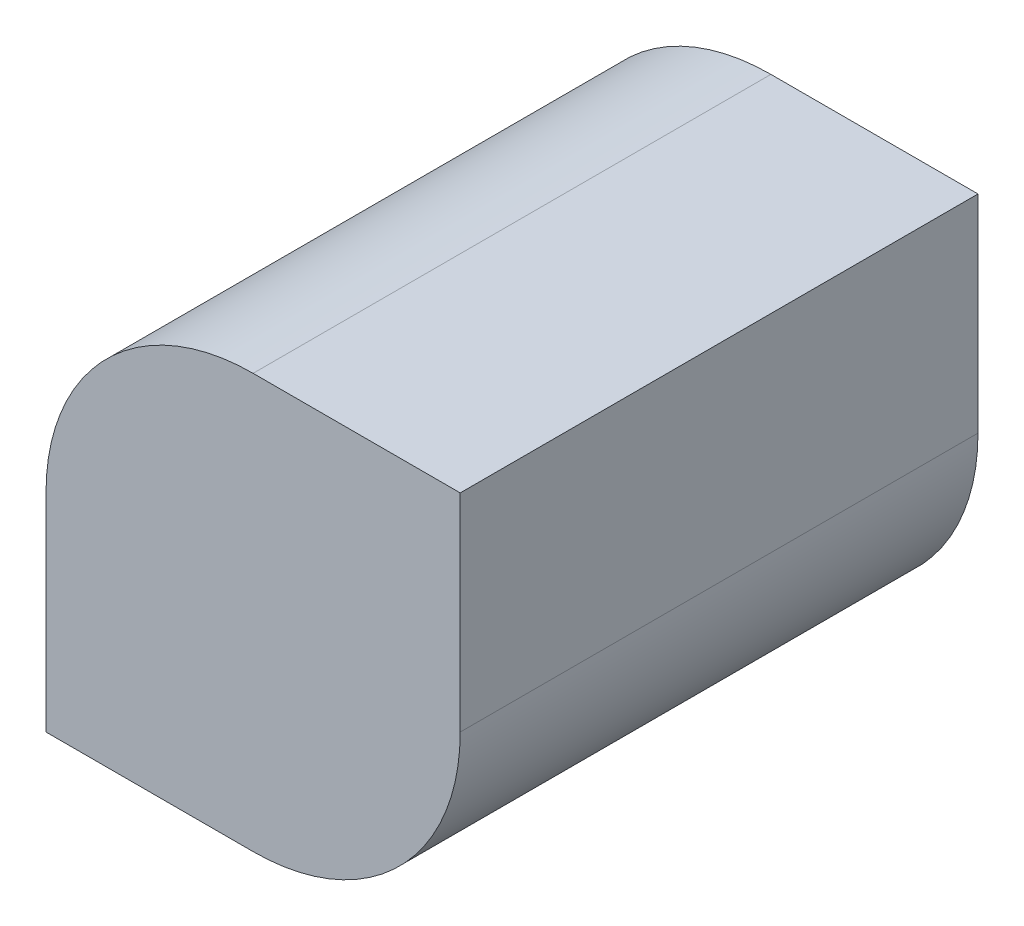
ISO-10303-21;
HEADER;
FILE_DESCRIPTION(('STEP AP214'),'2;1');
FILE_NAME('part.step','',(''),(''),'','','');
FILE_SCHEMA(('AUTOMOTIVE_DESIGN { 1 0 10303 214 1 1 1 1 }'));
ENDSEC;
DATA;
#1=APPLICATION_CONTEXT('core data for automotive mechanical design processes');
#2=APPLICATION_PROTOCOL_DEFINITION('international standard','automotive_design',2000,#1);
#3=PRODUCT_CONTEXT('',#1,'mechanical');
#4=PRODUCT('Part','Part','',(#3));
#5=PRODUCT_RELATED_PRODUCT_CATEGORY('part','',(#4));
#6=PRODUCT_DEFINITION_FORMATION('','',#4);
#7=PRODUCT_DEFINITION_CONTEXT('part definition',#1,'design');
#8=PRODUCT_DEFINITION('design','',#6,#7);
#9=PRODUCT_DEFINITION_SHAPE('','',#8);
#10=(LENGTH_UNIT() NAMED_UNIT(*) SI_UNIT(.MILLI.,.METRE.));
#11=(NAMED_UNIT(*) PLANE_ANGLE_UNIT() SI_UNIT($,.RADIAN.));
#12=(NAMED_UNIT(*) SI_UNIT($,.STERADIAN.) SOLID_ANGLE_UNIT());
#13=UNCERTAINTY_MEASURE_WITH_UNIT(LENGTH_MEASURE(1.E-05),#10,'distance_accuracy_value','');
#14=(GEOMETRIC_REPRESENTATION_CONTEXT(3) GLOBAL_UNCERTAINTY_ASSIGNED_CONTEXT((#13)) GLOBAL_UNIT_ASSIGNED_CONTEXT((#10,
#11,#12)) REPRESENTATION_CONTEXT('',''));
#15=CARTESIAN_POINT('',(0.,0.,0.));
#16=DIRECTION('',(0.,0.,1.));
#17=DIRECTION('',(1.,0.,0.));
#18=AXIS2_PLACEMENT_3D('',#15,#16,#17);
#19=CARTESIAN_POINT('',(-10.,10.,25.));
#20=DIRECTION('',(1.,0.,0.));
#21=DIRECTION('',(0.,1.,0.));
#22=AXIS2_PLACEMENT_3D('',#19,#20,#21);
#23=PLANE('',#22);
#24=DIRECTION('',(0.,-1.,0.));
#25=VECTOR('',#24,1.);
#26=CARTESIAN_POINT('',(-10.,10.,0.));
#27=LINE('',#26,#25);
#28=CARTESIAN_POINT('',(-10.,10.,0.));
#29=VERTEX_POINT('',#28);
#30=CARTESIAN_POINT('',(-10.,0.,0.));
#31=VERTEX_POINT('',#30);
#32=EDGE_CURVE('E117',#29,#31,#27,.T.);
#33=ORIENTED_EDGE('',*,*,#32,.T.);
#34=DIRECTION('',(0.,0.,-1.));
#35=VECTOR('',#34,1.);
#36=CARTESIAN_POINT('',(-10.,0.,25.));
#37=LINE('',#36,#35);
#38=CARTESIAN_POINT('',(-10.,0.,25.));
#39=VERTEX_POINT('',#38);
#40=EDGE_CURVE('E11',#39,#31,#37,.T.);
#41=ORIENTED_EDGE('',*,*,#40,.F.);
#42=DIRECTION('',(0.,-1.,0.));
#43=VECTOR('',#42,1.);
#44=CARTESIAN_POINT('',(-10.,10.,25.));
#45=LINE('',#44,#43);
#46=CARTESIAN_POINT('',(-10.,10.,25.));
#47=VERTEX_POINT('',#46);
#48=EDGE_CURVE('E127',#47,#39,#45,.T.);
#49=ORIENTED_EDGE('',*,*,#48,.F.);
#50=DIRECTION('',(0.,0.,-1.));
#51=VECTOR('',#50,1.);
#52=CARTESIAN_POINT('',(-10.,10.,25.));
#53=LINE('',#52,#51);
#54=EDGE_CURVE('E113',#47,#29,#53,.T.);
#55=ORIENTED_EDGE('',*,*,#54,.T.);
#56=EDGE_LOOP('',(#33,#41,#49,#55));
#57=FACE_BOUND('',#56,.T.);
#58=ADVANCED_FACE('F33',(#57),#23,.F.);
#59=CARTESIAN_POINT('',(-10.,0.,25.));
#60=DIRECTION('',(0.,1.,0.));
#61=DIRECTION('',(0.,0.,1.));
#62=AXIS2_PLACEMENT_3D('',#59,#60,#61);
#63=PLANE('',#62);
#64=DIRECTION('',(1.,0.,0.));
#65=VECTOR('',#64,1.);
#66=CARTESIAN_POINT('',(-10.,0.,0.));
#67=LINE('',#66,#65);
#68=CARTESIAN_POINT('',(0.,0.,0.));
#69=VERTEX_POINT('',#68);
#70=EDGE_CURVE('E120',#31,#69,#67,.T.);
#71=ORIENTED_EDGE('',*,*,#70,.T.);
#72=DIRECTION('',(0.,0.,-1.));
#73=VECTOR('',#72,1.);
#74=CARTESIAN_POINT('',(0.,0.,25.));
#75=LINE('',#74,#73);
#76=CARTESIAN_POINT('',(0.,0.,25.));
#77=VERTEX_POINT('',#76);
#78=EDGE_CURVE('E41',#77,#69,#75,.T.);
#79=ORIENTED_EDGE('',*,*,#78,.F.);
#80=DIRECTION('',(1.,0.,0.));
#81=VECTOR('',#80,1.);
#82=CARTESIAN_POINT('',(-10.,0.,25.));
#83=LINE('',#82,#81);
#84=EDGE_CURVE('E86',#39,#77,#83,.T.);
#85=ORIENTED_EDGE('',*,*,#84,.F.);
#86=ORIENTED_EDGE('',*,*,#40,.T.);
#87=EDGE_LOOP('',(#71,#79,#85,#86));
#88=FACE_BOUND('',#87,.T.);
#89=ADVANCED_FACE('F151',(#88),#63,.F.);
#90=CARTESIAN_POINT('',(0.,10.,25.));
#91=DIRECTION('',(0.,0.,-1.));
#92=DIRECTION('',(-1.,0.,0.));
#93=AXIS2_PLACEMENT_3D('',#90,#91,#92);
#94=CYLINDRICAL_SURFACE('',#93,10.);
#95=CARTESIAN_POINT('',(0.,10.,0.));
#96=DIRECTION('',(0.,0.,1.));
#97=DIRECTION('',(1.,0.,0.));
#98=AXIS2_PLACEMENT_3D('',#95,#96,#97);
#99=CIRCLE('',#98,10.);
#100=CARTESIAN_POINT('',(10.,10.,0.));
#101=VERTEX_POINT('',#100);
#102=EDGE_CURVE('E122',#69,#101,#99,.T.);
#103=ORIENTED_EDGE('',*,*,#102,.T.);
#104=DIRECTION('',(0.,0.,-1.));
#105=VECTOR('',#104,1.);
#106=CARTESIAN_POINT('',(10.,10.,25.));
#107=LINE('',#106,#105);
#108=CARTESIAN_POINT('',(10.,10.,25.));
#109=VERTEX_POINT('',#108);
#110=EDGE_CURVE('E108',#109,#101,#107,.T.);
#111=ORIENTED_EDGE('',*,*,#110,.F.);
#112=CARTESIAN_POINT('',(0.,10.,25.));
#113=DIRECTION('',(0.,0.,1.));
#114=DIRECTION('',(1.,0.,0.));
#115=AXIS2_PLACEMENT_3D('',#112,#113,#114);
#116=CIRCLE('',#115,10.);
#117=EDGE_CURVE('E99',#77,#109,#116,.T.);
#118=ORIENTED_EDGE('',*,*,#117,.F.);
#119=ORIENTED_EDGE('',*,*,#78,.T.);
#120=EDGE_LOOP('',(#103,#111,#118,#119));
#121=FACE_BOUND('',#120,.T.);
#122=ADVANCED_FACE('F133',(#121),#94,.T.);
#123=CARTESIAN_POINT('',(10.,10.,25.));
#124=DIRECTION('',(-1.,0.,0.));
#125=DIRECTION('',(0.,-1.,0.));
#126=AXIS2_PLACEMENT_3D('',#123,#124,#125);
#127=PLANE('',#126);
#128=DIRECTION('',(0.,1.,0.));
#129=VECTOR('',#128,1.);
#130=CARTESIAN_POINT('',(10.,10.,0.));
#131=LINE('',#130,#129);
#132=CARTESIAN_POINT('',(10.,20.,0.));
#133=VERTEX_POINT('',#132);
#134=EDGE_CURVE('E107',#101,#133,#131,.T.);
#135=ORIENTED_EDGE('',*,*,#134,.T.);
#136=DIRECTION('',(0.,0.,-1.));
#137=VECTOR('',#136,1.);
#138=CARTESIAN_POINT('',(10.,20.,25.));
#139=LINE('',#138,#137);
#140=CARTESIAN_POINT('',(10.,20.,25.));
#141=VERTEX_POINT('',#140);
#142=EDGE_CURVE('E104',#141,#133,#139,.T.);
#143=ORIENTED_EDGE('',*,*,#142,.F.);
#144=DIRECTION('',(0.,1.,0.));
#145=VECTOR('',#144,1.);
#146=CARTESIAN_POINT('',(10.,10.,25.));
#147=LINE('',#146,#145);
#148=EDGE_CURVE('E93',#109,#141,#147,.T.);
#149=ORIENTED_EDGE('',*,*,#148,.F.);
#150=ORIENTED_EDGE('',*,*,#110,.T.);
#151=EDGE_LOOP('',(#135,#143,#149,#150));
#152=FACE_BOUND('',#151,.T.);
#153=ADVANCED_FACE('F105',(#152),#127,.F.);
#154=CARTESIAN_POINT('',(10.,20.,25.));
#155=DIRECTION('',(0.,-1.,0.));
#156=DIRECTION('',(0.,0.,-1.));
#157=AXIS2_PLACEMENT_3D('',#154,#155,#156);
#158=PLANE('',#157);
#159=DIRECTION('',(-1.,0.,0.));
#160=VECTOR('',#159,1.);
#161=CARTESIAN_POINT('',(10.,20.,0.));
#162=LINE('',#161,#160);
#163=CARTESIAN_POINT('',(0.,20.,0.));
#164=VERTEX_POINT('',#163);
#165=EDGE_CURVE('E72',#133,#164,#162,.T.);
#166=ORIENTED_EDGE('',*,*,#165,.T.);
#167=DIRECTION('',(0.,0.,-1.));
#168=VECTOR('',#167,1.);
#169=CARTESIAN_POINT('',(0.,20.,25.));
#170=LINE('',#169,#168);
#171=CARTESIAN_POINT('',(0.,20.,25.));
#172=VERTEX_POINT('',#171);
#173=EDGE_CURVE('E109',#172,#164,#170,.T.);
#174=ORIENTED_EDGE('',*,*,#173,.F.);
#175=DIRECTION('',(-1.,0.,0.));
#176=VECTOR('',#175,1.);
#177=CARTESIAN_POINT('',(10.,20.,25.));
#178=LINE('',#177,#176);
#179=EDGE_CURVE('E97',#141,#172,#178,.T.);
#180=ORIENTED_EDGE('',*,*,#179,.F.);
#181=ORIENTED_EDGE('',*,*,#142,.T.);
#182=EDGE_LOOP('',(#166,#174,#180,#181));
#183=FACE_BOUND('',#182,.T.);
#184=ADVANCED_FACE('F111',(#183),#158,.F.);
#185=CARTESIAN_POINT('',(0.,10.,25.));
#186=DIRECTION('',(0.,0.,-1.));
#187=DIRECTION('',(-1.,0.,0.));
#188=AXIS2_PLACEMENT_3D('',#185,#186,#187);
#189=CYLINDRICAL_SURFACE('',#188,10.);
#190=CARTESIAN_POINT('',(0.,10.,0.));
#191=DIRECTION('',(0.,0.,1.));
#192=DIRECTION('',(1.,0.,0.));
#193=AXIS2_PLACEMENT_3D('',#190,#191,#192);
#194=CIRCLE('',#193,10.);
#195=EDGE_CURVE('E78',#164,#29,#194,.T.);
#196=ORIENTED_EDGE('',*,*,#195,.T.);
#197=ORIENTED_EDGE('',*,*,#54,.F.);
#198=CARTESIAN_POINT('',(0.,10.,25.));
#199=DIRECTION('',(0.,0.,1.));
#200=DIRECTION('',(1.,0.,0.));
#201=AXIS2_PLACEMENT_3D('',#198,#199,#200);
#202=CIRCLE('',#201,10.);
#203=EDGE_CURVE('E49',#172,#47,#202,.T.);
#204=ORIENTED_EDGE('',*,*,#203,.F.);
#205=ORIENTED_EDGE('',*,*,#173,.T.);
#206=EDGE_LOOP('',(#196,#197,#204,#205));
#207=FACE_BOUND('',#206,.T.);
#208=ADVANCED_FACE('F140',(#207),#189,.T.);
#209=CARTESIAN_POINT('',(0.,10.,25.));
#210=DIRECTION('',(0.,0.,1.));
#211=DIRECTION('',(1.,0.,0.));
#212=AXIS2_PLACEMENT_3D('',#209,#210,#211);
#213=PLANE('',#212);
#214=ORIENTED_EDGE('',*,*,#48,.T.);
#215=ORIENTED_EDGE('',*,*,#84,.T.);
#216=ORIENTED_EDGE('',*,*,#117,.T.);
#217=ORIENTED_EDGE('',*,*,#148,.T.);
#218=ORIENTED_EDGE('',*,*,#179,.T.);
#219=ORIENTED_EDGE('',*,*,#203,.T.);
#220=EDGE_LOOP('',(#214,#215,#216,#217,#218,#219));
#221=FACE_BOUND('',#220,.T.);
#222=ADVANCED_FACE('F95',(#221),#213,.T.);
#223=CARTESIAN_POINT('',(0.,10.,0.));
#224=DIRECTION('',(0.,0.,1.));
#225=DIRECTION('',(1.,0.,0.));
#226=AXIS2_PLACEMENT_3D('',#223,#224,#225);
#227=PLANE('',#226);
#228=ORIENTED_EDGE('',*,*,#32,.F.);
#229=ORIENTED_EDGE('',*,*,#195,.F.);
#230=ORIENTED_EDGE('',*,*,#165,.F.);
#231=ORIENTED_EDGE('',*,*,#134,.F.);
#232=ORIENTED_EDGE('',*,*,#102,.F.);
#233=ORIENTED_EDGE('',*,*,#70,.F.);
#234=EDGE_LOOP('',(#228,#229,#230,#231,#232,#233));
#235=FACE_BOUND('',#234,.T.);
#236=ADVANCED_FACE('F136',(#235),#227,.F.);
#237=CLOSED_SHELL('',(#58,#89,#122,#153,#184,#208,#222,#236));
#238=MANIFOLD_SOLID_BREP('B2',#237);
#239=ADVANCED_BREP_SHAPE_REPRESENTATION('',(#18,#238),#14);
#240=SHAPE_DEFINITION_REPRESENTATION(#9,#239);
ENDSEC;
END-ISO-10303-21;
